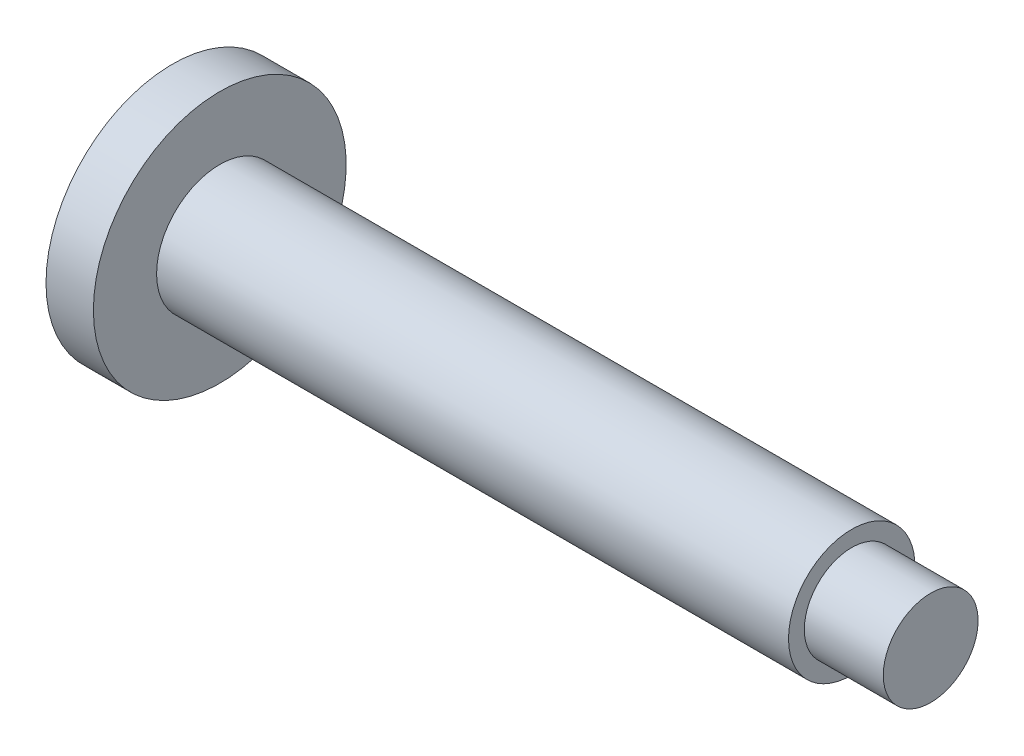
ISO-10303-21;
HEADER;
FILE_DESCRIPTION(('STEP AP214'),'2;1');
FILE_NAME('part.step','',(''),(''),'','','');
FILE_SCHEMA(('AUTOMOTIVE_DESIGN { 1 0 10303 214 1 1 1 1 }'));
ENDSEC;
DATA;
#1=APPLICATION_CONTEXT('core data for automotive mechanical design processes');
#2=APPLICATION_PROTOCOL_DEFINITION('international standard','automotive_design',2000,#1);
#3=PRODUCT_CONTEXT('',#1,'mechanical');
#4=PRODUCT('Part','Part','',(#3));
#5=PRODUCT_RELATED_PRODUCT_CATEGORY('part','',(#4));
#6=PRODUCT_DEFINITION_FORMATION('','',#4);
#7=PRODUCT_DEFINITION_CONTEXT('part definition',#1,'design');
#8=PRODUCT_DEFINITION('design','',#6,#7);
#9=PRODUCT_DEFINITION_SHAPE('','',#8);
#10=(LENGTH_UNIT() NAMED_UNIT(*) SI_UNIT(.MILLI.,.METRE.));
#11=(NAMED_UNIT(*) PLANE_ANGLE_UNIT() SI_UNIT($,.RADIAN.));
#12=(NAMED_UNIT(*) SI_UNIT($,.STERADIAN.) SOLID_ANGLE_UNIT());
#13=UNCERTAINTY_MEASURE_WITH_UNIT(LENGTH_MEASURE(1.E-05),#10,'distance_accuracy_value','');
#14=(GEOMETRIC_REPRESENTATION_CONTEXT(3) GLOBAL_UNCERTAINTY_ASSIGNED_CONTEXT((#13)) GLOBAL_UNIT_ASSIGNED_CONTEXT((#10,
#11,#12)) REPRESENTATION_CONTEXT('',''));
#15=CARTESIAN_POINT('',(0.,0.,0.));
#16=DIRECTION('',(0.,0.,1.));
#17=DIRECTION('',(1.,0.,0.));
#18=AXIS2_PLACEMENT_3D('',#15,#16,#17);
#19=CARTESIAN_POINT('',(0.,0.,0.));
#20=DIRECTION('',(1.,0.,0.));
#21=DIRECTION('',(0.,0.,-1.));
#22=AXIS2_PLACEMENT_3D('',#19,#20,#21);
#23=PLANE('',#22);
#24=CARTESIAN_POINT('',(0.,0.,0.));
#25=DIRECTION('',(-1.,0.,0.));
#26=DIRECTION('',(0.,0.,1.));
#27=AXIS2_PLACEMENT_3D('',#24,#25,#26);
#28=CIRCLE('',#27,8.);
#29=CARTESIAN_POINT('',(0.,0.,8.));
#30=VERTEX_POINT('',#29);
#31=EDGE_CURVE('E10',#30,#30,#28,.T.);
#32=ORIENTED_EDGE('',*,*,#31,.T.);
#33=EDGE_LOOP('',(#32));
#34=FACE_BOUND('',#33,.T.);
#35=ADVANCED_FACE('F33',(#34),#23,.F.);
#36=CARTESIAN_POINT('',(0.,0.,0.));
#37=DIRECTION('',(-1.,0.,0.));
#38=DIRECTION('',(0.,0.,1.));
#39=AXIS2_PLACEMENT_3D('',#36,#37,#38);
#40=CYLINDRICAL_SURFACE('',#39,8.);
#41=ORIENTED_EDGE('',*,*,#31,.F.);
#42=EDGE_LOOP('',(#41));
#43=FACE_BOUND('',#42,.T.);
#44=CARTESIAN_POINT('',(3.,0.,0.));
#45=DIRECTION('',(-1.,0.,0.));
#46=DIRECTION('',(0.,0.,1.));
#47=AXIS2_PLACEMENT_3D('',#44,#45,#46);
#48=CIRCLE('',#47,8.);
#49=CARTESIAN_POINT('',(3.,0.,8.));
#50=VERTEX_POINT('',#49);
#51=EDGE_CURVE('E39',#50,#50,#48,.T.);
#52=ORIENTED_EDGE('',*,*,#51,.T.);
#53=EDGE_LOOP('',(#52));
#54=FACE_BOUND('',#53,.T.);
#55=ADVANCED_FACE('F71',(#43,#54),#40,.T.);
#56=CARTESIAN_POINT('',(3.,8.,0.));
#57=DIRECTION('',(-1.,0.,0.));
#58=DIRECTION('',(0.,0.,1.));
#59=AXIS2_PLACEMENT_3D('',#56,#57,#58);
#60=PLANE('',#59);
#61=ORIENTED_EDGE('',*,*,#51,.F.);
#62=EDGE_LOOP('',(#61));
#63=FACE_BOUND('',#62,.T.);
#64=CARTESIAN_POINT('',(3.,0.,0.));
#65=DIRECTION('',(-1.,0.,0.));
#66=DIRECTION('',(0.,0.,1.));
#67=AXIS2_PLACEMENT_3D('',#64,#65,#66);
#68=CIRCLE('',#67,4.);
#69=CARTESIAN_POINT('',(3.,0.,4.));
#70=VERTEX_POINT('',#69);
#71=EDGE_CURVE('E43',#70,#70,#68,.T.);
#72=ORIENTED_EDGE('',*,*,#71,.T.);
#73=EDGE_LOOP('',(#72));
#74=FACE_BOUND('',#73,.T.);
#75=ADVANCED_FACE('F75',(#63,#74),#60,.F.);
#76=CARTESIAN_POINT('',(0.,0.,0.));
#77=DIRECTION('',(-1.,0.,0.));
#78=DIRECTION('',(0.,0.,1.));
#79=AXIS2_PLACEMENT_3D('',#76,#77,#78);
#80=CYLINDRICAL_SURFACE('',#79,4.);
#81=ORIENTED_EDGE('',*,*,#71,.F.);
#82=EDGE_LOOP('',(#81));
#83=FACE_BOUND('',#82,.T.);
#84=CARTESIAN_POINT('',(43.,0.,0.));
#85=DIRECTION('',(-1.,0.,0.));
#86=DIRECTION('',(0.,0.,1.));
#87=AXIS2_PLACEMENT_3D('',#84,#85,#86);
#88=CIRCLE('',#87,4.);
#89=CARTESIAN_POINT('',(43.,0.,4.));
#90=VERTEX_POINT('',#89);
#91=EDGE_CURVE('E47',#90,#90,#88,.T.);
#92=ORIENTED_EDGE('',*,*,#91,.T.);
#93=EDGE_LOOP('',(#92));
#94=FACE_BOUND('',#93,.T.);
#95=ADVANCED_FACE('F80',(#83,#94),#80,.T.);
#96=CARTESIAN_POINT('',(43.,4.,0.));
#97=DIRECTION('',(-1.,0.,0.));
#98=DIRECTION('',(0.,0.,1.));
#99=AXIS2_PLACEMENT_3D('',#96,#97,#98);
#100=PLANE('',#99);
#101=ORIENTED_EDGE('',*,*,#91,.F.);
#102=EDGE_LOOP('',(#101));
#103=FACE_BOUND('',#102,.T.);
#104=CARTESIAN_POINT('',(43.,0.,0.));
#105=DIRECTION('',(-1.,0.,0.));
#106=DIRECTION('',(0.,0.,1.));
#107=AXIS2_PLACEMENT_3D('',#104,#105,#106);
#108=CIRCLE('',#107,3.);
#109=CARTESIAN_POINT('',(43.,0.,3.));
#110=VERTEX_POINT('',#109);
#111=EDGE_CURVE('E52',#110,#110,#108,.T.);
#112=ORIENTED_EDGE('',*,*,#111,.T.);
#113=EDGE_LOOP('',(#112));
#114=FACE_BOUND('',#113,.T.);
#115=ADVANCED_FACE('F67',(#103,#114),#100,.F.);
#116=CARTESIAN_POINT('',(0.,0.,0.));
#117=DIRECTION('',(-1.,0.,0.));
#118=DIRECTION('',(0.,0.,1.));
#119=AXIS2_PLACEMENT_3D('',#116,#117,#118);
#120=CYLINDRICAL_SURFACE('',#119,3.);
#121=ORIENTED_EDGE('',*,*,#111,.F.);
#122=EDGE_LOOP('',(#121));
#123=FACE_BOUND('',#122,.T.);
#124=CARTESIAN_POINT('',(48.,0.,0.));
#125=DIRECTION('',(-1.,0.,0.));
#126=DIRECTION('',(0.,0.,1.));
#127=AXIS2_PLACEMENT_3D('',#124,#125,#126);
#128=CIRCLE('',#127,3.);
#129=CARTESIAN_POINT('',(48.,0.,3.));
#130=VERTEX_POINT('',#129);
#131=EDGE_CURVE('E55',#130,#130,#128,.T.);
#132=ORIENTED_EDGE('',*,*,#131,.T.);
#133=EDGE_LOOP('',(#132));
#134=FACE_BOUND('',#133,.T.);
#135=ADVANCED_FACE('F59',(#123,#134),#120,.T.);
#136=CARTESIAN_POINT('',(48.,3.,0.));
#137=DIRECTION('',(-1.,0.,0.));
#138=DIRECTION('',(0.,0.,1.));
#139=AXIS2_PLACEMENT_3D('',#136,#137,#138);
#140=PLANE('',#139);
#141=ORIENTED_EDGE('',*,*,#131,.F.);
#142=EDGE_LOOP('',(#141));
#143=FACE_BOUND('',#142,.T.);
#144=ADVANCED_FACE('F61',(#143),#140,.F.);
#145=CLOSED_SHELL('',(#35,#55,#75,#95,#115,#135,#144));
#146=MANIFOLD_SOLID_BREP('B2',#145);
#147=ADVANCED_BREP_SHAPE_REPRESENTATION('',(#18,#146),#14);
#148=SHAPE_DEFINITION_REPRESENTATION(#9,#147);
ENDSEC;
END-ISO-10303-21;
